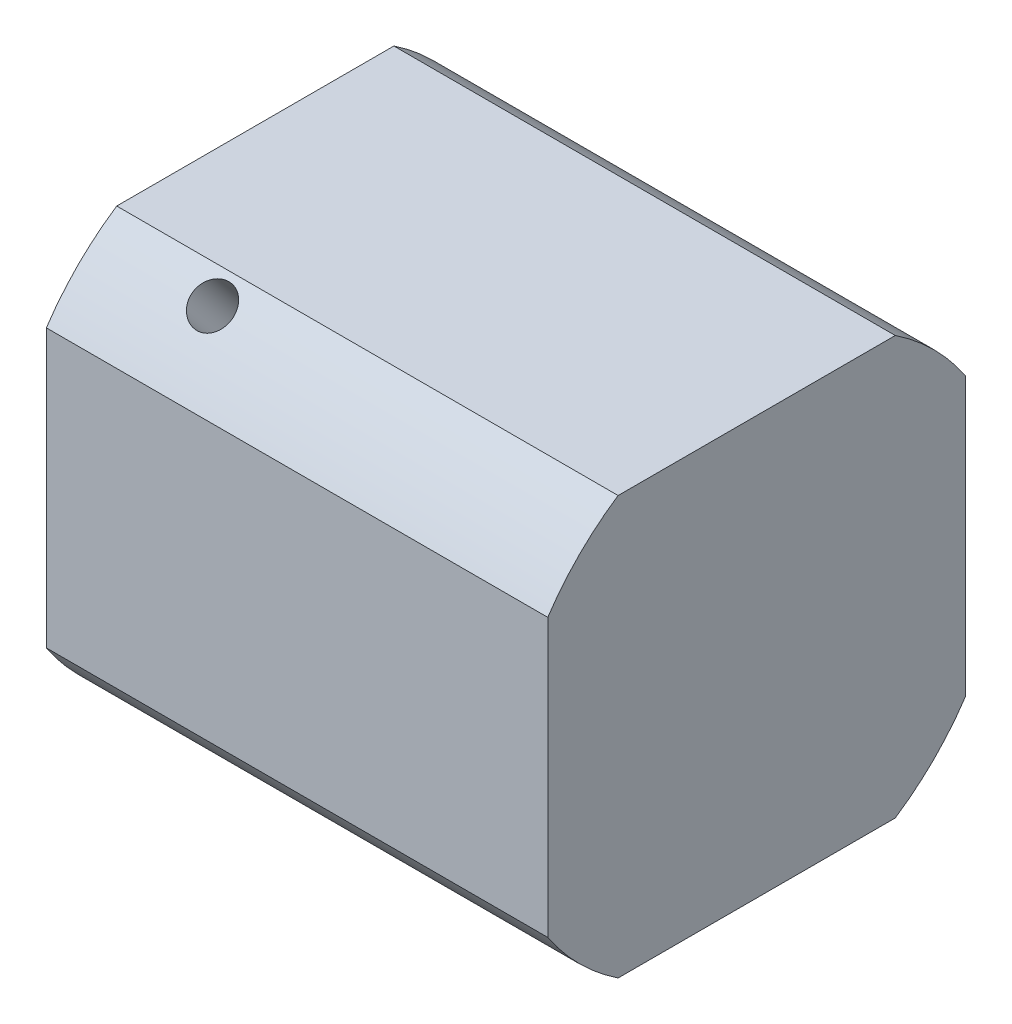
ISO-10303-21;
HEADER;
FILE_DESCRIPTION(('STEP AP214'),'2;1');
FILE_NAME('part.step','',(''),(''),'','','');
FILE_SCHEMA(('AUTOMOTIVE_DESIGN { 1 0 10303 214 1 1 1 1 }'));
ENDSEC;
DATA;
#1=APPLICATION_CONTEXT('core data for automotive mechanical design processes');
#2=APPLICATION_PROTOCOL_DEFINITION('international standard','automotive_design',2000,#1);
#3=PRODUCT_CONTEXT('',#1,'mechanical');
#4=PRODUCT('Part','Part','',(#3));
#5=PRODUCT_RELATED_PRODUCT_CATEGORY('part','',(#4));
#6=PRODUCT_DEFINITION_FORMATION('','',#4);
#7=PRODUCT_DEFINITION_CONTEXT('part definition',#1,'design');
#8=PRODUCT_DEFINITION('design','',#6,#7);
#9=PRODUCT_DEFINITION_SHAPE('','',#8);
#10=(LENGTH_UNIT() NAMED_UNIT(*) SI_UNIT(.MILLI.,.METRE.));
#11=(NAMED_UNIT(*) PLANE_ANGLE_UNIT() SI_UNIT($,.RADIAN.));
#12=(NAMED_UNIT(*) SI_UNIT($,.STERADIAN.) SOLID_ANGLE_UNIT());
#13=UNCERTAINTY_MEASURE_WITH_UNIT(LENGTH_MEASURE(1.E-05),#10,'distance_accuracy_value','');
#14=(GEOMETRIC_REPRESENTATION_CONTEXT(3) GLOBAL_UNCERTAINTY_ASSIGNED_CONTEXT((#13)) GLOBAL_UNIT_ASSIGNED_CONTEXT((#10,
#11,#12)) REPRESENTATION_CONTEXT('',''));
#15=CARTESIAN_POINT('',(0.,0.,0.));
#16=DIRECTION('',(0.,0.,1.));
#17=DIRECTION('',(1.,0.,0.));
#18=AXIS2_PLACEMENT_3D('',#15,#16,#17);
#19=CARTESIAN_POINT('',(8.94144685316528,14.6267227549851,12.2049777324172));
#20=DIRECTION('',(0.,0.767806968765624,0.640681245796179));
#21=DIRECTION('',(0.,-0.640681245796179,0.767806968765624));
#22=AXIS2_PLACEMENT_3D('',#19,#20,#21);
#23=CYLINDRICAL_SURFACE('',#22,1.57499999999999);
#24=CARTESIAN_POINT('',(8.94144685316528,-8.22176024778748,-4.80918739787728));
#25=CARTESIAN_POINT('',(9.02926399454272,-8.22175919164569,-4.80919112455586));
#26=CARTESIAN_POINT('',(9.11712934080105,-8.21799448924617,-4.81564323728923));
#27=CARTESIAN_POINT('',(9.29039540475437,-8.20296177163691,-4.84120383939345));
#28=CARTESIAN_POINT('',(9.37579376217142,-8.19168680391441,-4.86032405597937));
#29=CARTESIAN_POINT('',(9.54159318961236,-8.16174849114987,-4.91043098441002));
#30=CARTESIAN_POINT('',(9.62199834376408,-8.14309127892166,-4.94140784562869));
#31=CARTESIAN_POINT('',(9.775662297122,-8.09857757350153,-5.01402749850224));
#32=CARTESIAN_POINT('',(9.84892191394997,-8.07272190529458,-5.05566906787569));
#33=CARTESIAN_POINT('',(9.98693510663064,-8.01383832024917,-5.14850067728718));
#34=CARTESIAN_POINT('',(10.0516092797529,-7.9807500614335,-5.19977050646986));
#35=CARTESIAN_POINT('',(10.1699261798341,-7.90796457365892,-5.30980832658838));
#36=CARTESIAN_POINT('',(10.223568256973,-7.86826695564007,-5.36857675888191));
#37=CARTESIAN_POINT('',(10.3185958623459,-7.78263504962183,-5.4919833791585));
#38=CARTESIAN_POINT('',(10.3599075556684,-7.73666550203273,-5.55665401396031));
#39=CARTESIAN_POINT('',(10.4286271845358,-7.63956284496641,-5.68941649194032));
#40=CARTESIAN_POINT('',(10.4560360100818,-7.58843006626808,-5.75750811581494));
#41=CARTESIAN_POINT('',(10.4959291876926,-7.48266942826353,-5.89429263384931));
#42=CARTESIAN_POINT('',(10.5085469161604,-7.42807755739819,-5.96297443902625));
#43=CARTESIAN_POINT('',(10.5189144234418,-7.31642911407044,-6.09944749918406));
#44=CARTESIAN_POINT('',(10.5166651976883,-7.25937270687784,-6.16723881348416));
#45=CARTESIAN_POINT('',(10.4974667612196,-7.14503576534619,-6.29933718876725));
#46=CARTESIAN_POINT('',(10.4806610857017,-7.08776283985666,-6.3636717762989));
#47=CARTESIAN_POINT('',(10.4330527593047,-6.97422931630766,-6.48789920164634));
#48=CARTESIAN_POINT('',(10.4022496873818,-6.91796874875302,-6.54779190578654));
#49=CARTESIAN_POINT('',(10.3273779531169,-6.80806347840173,-6.66199762653039));
#50=CARTESIAN_POINT('',(10.2832500410035,-6.7544317291641,-6.7162842376669));
#51=CARTESIAN_POINT('',(10.183024652522,-6.65191253088368,-6.81783684886062));
#52=CARTESIAN_POINT('',(10.1269262222319,-6.60302546039282,-6.86510228889639));
#53=CARTESIAN_POINT('',(10.0035558353622,-6.51122305294064,-6.95224140262823));
#54=CARTESIAN_POINT('',(9.93615843924109,-6.46838600631264,-6.99202005844049));
#55=CARTESIAN_POINT('',(9.79252623001559,-6.39106139995046,-7.06276960242587));
#56=CARTESIAN_POINT('',(9.71629133785913,-6.35657391491228,-7.09374041180356));
#57=CARTESIAN_POINT('',(9.55700656867001,-6.29734437940789,-7.14637376680492));
#58=CARTESIAN_POINT('',(9.47394935636691,-6.27261298876448,-7.16802613313366));
#59=CARTESIAN_POINT('',(9.30345620714185,-6.23403834359794,-7.20160060056799));
#60=CARTESIAN_POINT('',(9.21602065004513,-6.22019414633585,-7.21352354416274));
#61=CARTESIAN_POINT('',(9.04035382397863,-6.20411982693464,-7.22735323917685));
#62=CARTESIAN_POINT('',(8.95214399848248,-6.20175506253321,-7.22937611084924));
#63=CARTESIAN_POINT('',(8.77647106065445,-6.20838193565479,-7.2236858383133));
#64=CARTESIAN_POINT('',(8.68900792007997,-6.21737314171673,-7.21597306400311));
#65=CARTESIAN_POINT('',(8.51786721378284,-6.24621341566057,-7.19102211908332));
#66=CARTESIAN_POINT('',(8.43416949990808,-6.26599465798727,-7.17384344378678));
#67=CARTESIAN_POINT('',(8.27229638016093,-6.31551399652409,-7.13028672848812));
#68=CARTESIAN_POINT('',(8.19412130030519,-6.3452526799562,-7.10390814593438));
#69=CARTESIAN_POINT('',(8.04473136517757,-6.41377615333873,-7.04210483514434));
#70=CARTESIAN_POINT('',(7.97358619381933,-6.45264067050654,-7.00660010201662));
#71=CARTESIAN_POINT('',(7.84099571492951,-6.5377320791714,-6.92726927540981));
#72=CARTESIAN_POINT('',(7.7795510790919,-6.58395948005163,-6.8834426061575));
#73=CARTESIAN_POINT('',(7.6674661610961,-6.68255257178213,-6.7877738093552));
#74=CARTESIAN_POINT('',(7.61694280589357,-6.73497620575577,-6.73585428910763));
#75=CARTESIAN_POINT('',(7.5289532741792,-6.84366738255725,-6.62539334367439));
#76=CARTESIAN_POINT('',(7.49148668044855,-6.89993480249113,-6.56685213015904));
#77=CARTESIAN_POINT('',(7.43085656628039,-7.01410719186957,-6.44475559386002));
#78=CARTESIAN_POINT('',(7.40763163316381,-7.0720039879709,-6.38122315197668));
#79=CARTESIAN_POINT('',(7.3759462790557,-7.18776013060921,-6.25054740023948));
#80=CARTESIAN_POINT('',(7.36748466307747,-7.24561947979825,-6.18340438308985));
#81=CARTESIAN_POINT('',(7.36560009484521,-7.35884187761506,-6.04820260596645));
#82=CARTESIAN_POINT('',(7.37199915295376,-7.41422645592679,-5.98016429006327));
#83=CARTESIAN_POINT('',(7.39926958902944,-7.52171112473261,-5.84439779852765));
#84=CARTESIAN_POINT('',(7.42014088903941,-7.5738112329174,-5.77666962122656));
#85=CARTESIAN_POINT('',(7.47569546563919,-7.67342296551739,-5.64367841605689));
#86=CARTESIAN_POINT('',(7.5103638381925,-7.72093947269542,-5.57841281105778));
#87=CARTESIAN_POINT('',(7.59250870452246,-7.81048552326937,-5.45233229515084));
#88=CARTESIAN_POINT('',(7.63998579003026,-7.85251481303615,-5.39151759002872));
#89=CARTESIAN_POINT('',(7.74703241093659,-7.93081904300463,-5.27566916073416));
#90=CARTESIAN_POINT('',(7.80673237602719,-7.96702368518996,-5.22070842797659));
#91=CARTESIAN_POINT('',(7.93625629136158,-8.03259193119149,-5.11925289365817));
#92=CARTESIAN_POINT('',(8.00608260965657,-8.06195393065478,-5.07276007807558));
#93=CARTESIAN_POINT('',(8.15445295267042,-8.11365609660982,-4.9896521806447));
#94=CARTESIAN_POINT('',(8.23305419334402,-8.13594604245148,-4.95310799568998));
#95=CARTESIAN_POINT('',(8.39632487069252,-8.17296948337121,-4.89177770251323));
#96=CARTESIAN_POINT('',(8.48098812761879,-8.18771055236758,-4.86697981091449));
#97=CARTESIAN_POINT('',(8.62856226132541,-8.206318085818,-4.83551326896205));
#98=CARTESIAN_POINT('',(8.69057804892894,-8.21210532589345,-4.82566158888635));
#99=CARTESIAN_POINT('',(8.81553659179634,-8.21982675144684,-4.81249737510196));
#100=CARTESIAN_POINT('',(8.87847933064532,-8.2217610050728,-4.80918472573703));
#101=CARTESIAN_POINT('',(8.94144685316528,-8.22176024778748,-4.80918739787728));
#102=B_SPLINE_CURVE_WITH_KNOTS('',3,(#24,#25,#26,#27,#28,#29,#30,#31,#32,#33,#34,#35,#36,#37,
#38,#39,#40,#41,#42,#43,#44,#45,#46,#47,#48,#49,#50,#51,#52,#53,#54,#55,#56,#57,#58,#59,#60,#61,
#62,#63,#64,#65,#66,#67,#68,#69,#70,#71,#72,#73,#74,#75,#76,#77,#78,#79,#80,#81,#82,#83,#84,#85,
#86,#87,#88,#89,#90,#91,#92,#93,#94,#95,#96,#97,#98,#99,#100,#101),.UNSPECIFIED.,.T.,.F.,(4,2,2,
2,2,2,2,2,2,2,2,2,2,2,2,2,2,2,2,2,2,2,2,2,2,2,2,2,2,2,2,2,2,2,2,2,2,2,4),(0.,0.263221171945587,
0.52668635612965,0.789933124104301,1.05314973487683,1.31865243166966,1.58417076280845,
1.85124852370316,2.11830918528511,2.38294267867809,2.64755845342946,2.90959428671084,
3.17163800259253,3.43486451410984,3.69811200979404,3.96450335602607,4.2308970853331,
4.49758108410441,4.76424198775115,5.02776754127061,5.29128308264712,5.55316095546549,
5.81505427477641,6.07932682986698,6.34361767595834,6.61061151748956,6.87759682665462,
7.14342259735303,7.4092268503262,7.67186395190721,7.93449963876049,8.19685238493934,
8.45921725324806,8.72454321048403,8.98993131463858,9.25716388944,9.52412781728391,
9.7128686254251,9.90160609526572),.UNSPECIFIED.);
#103=CARTESIAN_POINT('',(8.94144685316528,-8.22176024778748,-4.80918739787728));
#104=VERTEX_POINT('',#103);
#105=EDGE_CURVE('E38',#104,#104,#102,.T.);
#106=ORIENTED_EDGE('',*,*,#105,.T.);
#107=EDGE_LOOP('',(#106));
#108=FACE_BOUND('',#107,.T.);
#109=CARTESIAN_POINT('',(8.94144685316528,-15.5857194143861,-10.9538965823139));
#110=CARTESIAN_POINT('',(9.02975293434592,-15.5857176059114,-10.9539000987928));
#111=CARTESIAN_POINT('',(9.11811919436211,-15.5814234592147,-10.9600169726329));
#112=CARTESIAN_POINT('',(9.29240691443076,-15.5643170307222,-10.9842954884525));
#113=CARTESIAN_POINT('',(9.3783254862134,-15.5514950877057,-11.0024707914821));
#114=CARTESIAN_POINT('',(9.54516832167466,-15.5175889849179,-11.0502391302885));
#115=CARTESIAN_POINT('',(9.62609537981442,-15.4965094975687,-11.0798257090004));
#116=CARTESIAN_POINT('',(9.78070156522972,-15.4465158744083,-11.1494158622721));
#117=CARTESIAN_POINT('',(9.85438224132458,-15.4176034177737,-11.189417204117));
#118=CARTESIAN_POINT('',(9.99260981129438,-15.3524639047996,-11.2786258112236));
#119=CARTESIAN_POINT('',(10.0571358546553,-15.3162205927773,-11.3278535172076));
#120=CARTESIAN_POINT('',(10.1750433961016,-15.2372390336165,-11.4338710410171));
#121=CARTESIAN_POINT('',(10.2284244080875,-15.1945005033242,-11.4906611885078));
#122=CARTESIAN_POINT('',(10.3225958158341,-15.1034356020492,-11.6100978410472));
#123=CARTESIAN_POINT('',(10.3633681914421,-15.0551013679934,-11.6727525627362));
#124=CARTESIAN_POINT('',(10.4310496790062,-14.954066613043,-11.8019111640938));
#125=CARTESIAN_POINT('',(10.4579590302277,-14.9013661675241,-11.8684149773078));
#126=CARTESIAN_POINT('',(10.4970906482031,-14.7930857717811,-12.0031062159891));
#127=CARTESIAN_POINT('',(10.5093466222986,-14.7375127380813,-12.0712894078609));
#128=CARTESIAN_POINT('',(10.5189277806984,-14.6248947339669,-12.2074878975451));
#129=CARTESIAN_POINT('',(10.516253238744,-14.5678497905579,-12.2755031984128));
#130=CARTESIAN_POINT('',(10.4960768608438,-14.4540697918416,-12.4092731584012));
#131=CARTESIAN_POINT('',(10.4786112725838,-14.397334319918,-12.4750329354605));
#132=CARTESIAN_POINT('',(10.4294049438446,-14.2857307879138,-12.6026817933761));
#133=CARTESIAN_POINT('',(10.3976640693503,-14.2308627453696,-12.6645708378881));
#134=CARTESIAN_POINT('',(10.3207677531373,-14.1246337200355,-12.782940243306));
#135=CARTESIAN_POINT('',(10.2755960707414,-14.0732770762732,-12.8394139459528));
#136=CARTESIAN_POINT('',(10.173132190233,-13.9757934930027,-12.9454583671629));
#137=CARTESIAN_POINT('',(10.1158397501841,-13.9296666579122,-12.9950289479037));
#138=CARTESIAN_POINT('',(9.99055636711518,-13.8440422763043,-13.0862112857856));
#139=CARTESIAN_POINT('',(9.92253392842596,-13.8045649766378,-13.1277987874565));
#140=CARTESIAN_POINT('',(9.77783123847273,-13.7337624971235,-13.2018521778587));
#141=CARTESIAN_POINT('',(9.70115098023327,-13.7024373238438,-13.2343180592407));
#142=CARTESIAN_POINT('',(9.54128721348498,-13.6490404224496,-13.2893820049632));
#143=CARTESIAN_POINT('',(9.45810292213213,-13.626969810281,-13.3119788792795));
#144=CARTESIAN_POINT('',(9.28760292120565,-13.5928856795716,-13.3467807903607));
#145=CARTESIAN_POINT('',(9.20028729714746,-13.5808719529571,-13.3589860421252));
#146=CARTESIAN_POINT('',(9.02427964364052,-13.5673624513692,-13.3727061736215));
#147=CARTESIAN_POINT('',(8.93559244853414,-13.5658356752396,-13.3742525627578));
#148=CARTESIAN_POINT('',(8.75911629301448,-13.5732739820519,-13.3667034228312));
#149=CARTESIAN_POINT('',(8.67132732436395,-13.582238968691,-13.3576079914484));
#150=CARTESIAN_POINT('',(8.49926603638261,-13.6103119101839,-13.3290024473715));
#151=CARTESIAN_POINT('',(8.41498891361372,-13.6294054849789,-13.3095070997338));
#152=CARTESIAN_POINT('',(8.25219486062949,-13.6770387858237,-13.2605531428653));
#153=CARTESIAN_POINT('',(8.17367802143846,-13.7055786611052,-13.2310943762333));
#154=CARTESIAN_POINT('',(8.02443171487802,-13.7711758909971,-13.1628056625279));
#155=CARTESIAN_POINT('',(7.95372088731269,-13.80825300731,-13.1239539624323));
#156=CARTESIAN_POINT('',(7.82228219241605,-13.8896103799068,-13.0378189856798));
#157=CARTESIAN_POINT('',(7.7615544942298,-13.9338907582109,-12.9905355661917));
#158=CARTESIAN_POINT('',(7.65165557662873,-14.0282881178731,-12.8885400062747));
#159=CARTESIAN_POINT('',(7.60251297687583,-14.0784191055092,-12.8338099846533));
#160=CARTESIAN_POINT('',(7.51737558604019,-14.1827926363273,-12.718370174501));
#161=CARTESIAN_POINT('',(7.48138066534545,-14.2370351389709,-12.6576604449266));
#162=CARTESIAN_POINT('',(7.42360956890603,-14.3478455947979,-12.5319126650288));
#163=CARTESIAN_POINT('',(7.40181568033173,-14.4044105571736,-12.466880118583));
#164=CARTESIAN_POINT('',(7.37300740268123,-14.5182038135406,-12.3341758662625));
#165=CARTESIAN_POINT('',(7.36599273867813,-14.5754320951727,-12.266504209505));
#166=CARTESIAN_POINT('',(7.36694521665486,-14.6887089326043,-12.1306277935097));
#167=CARTESIAN_POINT('',(7.37486774953571,-14.7447604972141,-12.0624252254741));
#168=CARTESIAN_POINT('',(7.40537672379141,-14.8543097847326,-11.9272608592733));
#169=CARTESIAN_POINT('',(7.42796318533708,-14.9078075041283,-11.8602990628149));
#170=CARTESIAN_POINT('',(7.48714757330753,-15.0108499047398,-11.7296127396935));
#171=CARTESIAN_POINT('',(7.52374471769796,-15.0603948064036,-11.6658880325709));
#172=CARTESIAN_POINT('',(7.60990647108393,-15.1543206204145,-11.543613721667));
#173=CARTESIAN_POINT('',(7.65947087035417,-15.1987016162629,-11.4850640342084));
#174=CARTESIAN_POINT('',(7.77032758132035,-15.2813978899364,-11.3748032921989));
#175=CARTESIAN_POINT('',(7.83165288735075,-15.3196955352333,-11.3231121860081));
#176=CARTESIAN_POINT('',(7.96423134301271,-15.3892429852386,-11.2284087150631));
#177=CARTESIAN_POINT('',(8.03548689425319,-15.420491080226,-11.1853984559325));
#178=CARTESIAN_POINT('',(8.18603940124892,-15.47532426927,-11.1094124633015));
#179=CARTESIAN_POINT('',(8.26535099365917,-15.4988950758989,-11.0764554460253));
#180=CARTESIAN_POINT('',(8.42960356174333,-15.5377947396742,-11.0218224355655));
#181=CARTESIAN_POINT('',(8.51453793356577,-15.5531330793489,-11.000133464263));
#182=CARTESIAN_POINT('',(8.65688619554469,-15.5713651040083,-10.9742987301047));
#183=CARTESIAN_POINT('',(8.71338440123248,-15.5767427486386,-10.9666596927631));
#184=CARTESIAN_POINT('',(8.82706227221772,-15.5839204848772,-10.956457486569));
#185=CARTESIAN_POINT('',(8.8842419357175,-15.5857205859208,-10.9538943043294));
#186=CARTESIAN_POINT('',(8.94144685316528,-15.5857194143861,-10.9538965823139));
#187=B_SPLINE_CURVE_WITH_KNOTS('',3,(#109,#110,#111,#112,#113,#114,#115,#116,#117,#118,#119,
#120,#121,#122,#123,#124,#125,#126,#127,#128,#129,#130,#131,#132,#133,#134,#135,#136,#137,#138,
#139,#140,#141,#142,#143,#144,#145,#146,#147,#148,#149,#150,#151,#152,#153,#154,#155,#156,#157,
#158,#159,#160,#161,#162,#163,#164,#165,#166,#167,#168,#169,#170,#171,#172,#173,#174,#175,#176,
#177,#178,#179,#180,#181,#182,#183,#184,#185,#186),.UNSPECIFIED.,.T.,.F.,(4,2,2,2,2,2,2,2,2,2,2,
2,2,2,2,2,2,2,2,2,2,2,2,2,2,2,2,2,2,2,2,2,2,2,2,2,2,2,4),(0.,0.264709378720021,
0.529719161180244,0.794579207462513,1.05938251978288,1.32477958306579,1.5901882194375,
1.85597444092644,2.12175607499038,2.38692514476949,2.65208935286461,2.91660561034698,
3.18112435113602,3.44596426075637,3.71080945721035,3.97644703555231,4.24208482791534,
4.50775464256719,4.77341896045944,5.03829759149053,5.30317379124811,5.56767493567427,
5.83218025886277,6.097304116698,6.3624324660881,6.62820907754634,6.89398306886406,
7.15942492469851,7.42486184267223,7.6895073036178,7.95415312859427,8.21878418398673,
8.48341095964591,8.74879128281518,9.01423589940045,9.2801717226114,9.54580056791524,
9.71728046932578,9.88875991847445),.UNSPECIFIED.);
#188=CARTESIAN_POINT('',(8.94144685316528,-15.5857194143861,-10.9538965823139));
#189=VERTEX_POINT('',#188);
#190=EDGE_CURVE('E148',#189,#189,#187,.T.);
#191=ORIENTED_EDGE('',*,*,#190,.F.);
#192=EDGE_LOOP('',(#191));
#193=FACE_BOUND('',#192,.T.);
#194=ADVANCED_FACE('F34',(#108,#193),#23,.F.);
#195=CARTESIAN_POINT('',(0.,0.,0.));
#196=DIRECTION('',(1.,0.,0.));
#197=DIRECTION('',(0.,0.,-1.));
#198=AXIS2_PLACEMENT_3D('',#195,#196,#197);
#199=PLANE('',#198);
#200=CARTESIAN_POINT('',(0.,0.,0.));
#201=DIRECTION('',(-1.,0.,0.));
#202=DIRECTION('',(0.,0.,1.));
#203=AXIS2_PLACEMENT_3D('',#200,#201,#202);
#204=CIRCLE('',#203,9.525);
#205=CARTESIAN_POINT('',(0.,0.,9.525));
#206=VERTEX_POINT('',#205);
#207=EDGE_CURVE('E215',#206,#206,#204,.T.);
#208=ORIENTED_EDGE('',*,*,#207,.F.);
#209=EDGE_LOOP('',(#208));
#210=FACE_BOUND('',#209,.T.);
#211=DIRECTION('',(0.,1.,0.));
#212=VECTOR('',#211,1.);
#213=CARTESIAN_POINT('',(0.,15.875,15.875));
#214=LINE('',#213,#212);
#215=CARTESIAN_POINT('',(0.,-10.5302837093784,15.875));
#216=VERTEX_POINT('',#215);
#217=CARTESIAN_POINT('',(0.,10.5302837093784,15.875));
#218=VERTEX_POINT('',#217);
#219=EDGE_CURVE('E116',#216,#218,#214,.T.);
#220=ORIENTED_EDGE('',*,*,#219,.T.);
#221=CARTESIAN_POINT('',(0.,0.,0.));
#222=DIRECTION('',(-1.,0.,0.));
#223=DIRECTION('',(0.,0.,1.));
#224=AXIS2_PLACEMENT_3D('',#221,#222,#223);
#225=CIRCLE('',#224,19.05);
#226=CARTESIAN_POINT('',(0.,15.875,10.5302837093784));
#227=VERTEX_POINT('',#226);
#228=EDGE_CURVE('E123',#218,#227,#225,.T.);
#229=ORIENTED_EDGE('',*,*,#228,.T.);
#230=DIRECTION('',(0.,0.,-1.));
#231=VECTOR('',#230,1.);
#232=CARTESIAN_POINT('',(0.,15.875,15.875));
#233=LINE('',#232,#231);
#234=CARTESIAN_POINT('',(0.,15.875,-10.5302837093784));
#235=VERTEX_POINT('',#234);
#236=EDGE_CURVE('E104',#227,#235,#233,.T.);
#237=ORIENTED_EDGE('',*,*,#236,.T.);
#238=CARTESIAN_POINT('',(0.,10.5302837093784,-15.875));
#239=VERTEX_POINT('',#238);
#240=EDGE_CURVE('E131',#235,#239,#225,.T.);
#241=ORIENTED_EDGE('',*,*,#240,.T.);
#242=DIRECTION('',(0.,-1.,0.));
#243=VECTOR('',#242,1.);
#244=CARTESIAN_POINT('',(0.,15.875,-15.875));
#245=LINE('',#244,#243);
#246=CARTESIAN_POINT('',(0.,-10.5302837093784,-15.875));
#247=VERTEX_POINT('',#246);
#248=EDGE_CURVE('E115',#239,#247,#245,.T.);
#249=ORIENTED_EDGE('',*,*,#248,.T.);
#250=CARTESIAN_POINT('',(0.,-15.875,-10.5302837093784));
#251=VERTEX_POINT('',#250);
#252=EDGE_CURVE('E137',#247,#251,#225,.T.);
#253=ORIENTED_EDGE('',*,*,#252,.T.);
#254=DIRECTION('',(0.,0.,1.));
#255=VECTOR('',#254,1.);
#256=CARTESIAN_POINT('',(0.,-15.875,15.875));
#257=LINE('',#256,#255);
#258=CARTESIAN_POINT('',(0.,-15.875,10.5302837093784));
#259=VERTEX_POINT('',#258);
#260=EDGE_CURVE('E126',#251,#259,#257,.T.);
#261=ORIENTED_EDGE('',*,*,#260,.T.);
#262=EDGE_CURVE('E133',#259,#216,#225,.T.);
#263=ORIENTED_EDGE('',*,*,#262,.T.);
#264=EDGE_LOOP('',(#220,#229,#237,#241,#249,#253,#261,#263));
#265=FACE_BOUND('',#264,.T.);
#266=ADVANCED_FACE('F36',(#210,#265),#199,.F.);
#267=CARTESIAN_POINT('',(0.,0.,0.));
#268=DIRECTION('',(-1.,0.,0.));
#269=DIRECTION('',(0.,0.,1.));
#270=AXIS2_PLACEMENT_3D('',#267,#268,#269);
#271=CYLINDRICAL_SURFACE('',#270,19.05);
#272=CARTESIAN_POINT('',(8.94144685316528,13.5675734901281,13.3724885339256));
#273=CARTESIAN_POINT('',(8.85314077198465,13.5675766259608,13.3724861250342));
#274=CARTESIAN_POINT('',(8.76477451196845,13.5728257565207,13.3671661184747));
#275=CARTESIAN_POINT('',(8.59048679189981,13.5936489155074,13.3459889544534));
#276=CARTESIAN_POINT('',(8.50456822011716,13.6092346543182,13.330119845825));
#277=CARTESIAN_POINT('',(8.3377253846559,13.650159951382,13.2882085340009));
#278=CARTESIAN_POINT('',(8.25679832651615,13.6754939935433,13.2621720838867));
#279=CARTESIAN_POINT('',(8.10219214110085,13.7350078915435,13.2005259345023));
#280=CARTESIAN_POINT('',(8.02851146500599,13.7691858514153,13.1649182870508));
#281=CARTESIAN_POINT('',(7.89028389503619,13.8452892018586,13.084858235941));
#282=CARTESIAN_POINT('',(7.82575785167525,13.8872317921484,13.0403861792921));
#283=CARTESIAN_POINT('',(7.70785031022897,13.9773939225187,12.943698060636));
#284=CARTESIAN_POINT('',(7.65446929824311,14.0256137362367,12.8914816610228));
#285=CARTESIAN_POINT('',(7.56029789049648,14.126814545656,12.7805027153307));
#286=CARTESIAN_POINT('',(7.51952551488848,14.1798022172858,12.7217309620224));
#287=CARTESIAN_POINT('',(7.45184402732439,14.2887827066269,12.5992025206078));
#288=CARTESIAN_POINT('',(7.42493467610287,14.3447754724541,12.5354459185581));
#289=CARTESIAN_POINT('',(7.38580305812743,14.4579018176366,12.4047982859526));
#290=CARTESIAN_POINT('',(7.37354708403198,14.515032470254,12.3379148181902));
#291=CARTESIAN_POINT('',(7.36396592563214,14.6288650370069,12.20272979613));
#292=CARTESIAN_POINT('',(7.36664046758659,14.6855669589839,12.1344282678543));
#293=CARTESIAN_POINT('',(7.38681684548677,14.7968021823472,11.9985348707135));
#294=CARTESIAN_POINT('',(7.40428243374675,14.8513404443643,11.930941675572));
#295=CARTESIAN_POINT('',(7.45348876248597,14.9569431959029,11.7982855858118));
#296=CARTESIAN_POINT('',(7.48522963698031,15.0080076528074,11.7332227149539));
#297=CARTESIAN_POINT('',(7.56212595319328,15.1054432493465,11.6075158078664));
#298=CARTESIAN_POINT('',(7.60729763558912,15.1518086152507,11.546877232737));
#299=CARTESIAN_POINT('',(7.70976151609755,15.2386843268794,11.431981284131));
#300=CARTESIAN_POINT('',(7.76705395614642,15.2791945557053,11.3777240380627));
#301=CARTESIAN_POINT('',(7.89233733921538,15.353571819716,11.2771567667185));
#302=CARTESIAN_POINT('',(7.96035977790461,15.3874186167237,11.2308710041503));
#303=CARTESIAN_POINT('',(8.10506246785783,15.4475976902121,11.1479531239947));
#304=CARTESIAN_POINT('',(8.18174272609729,15.4739299606384,11.111321014185));
#305=CARTESIAN_POINT('',(8.34160649284559,15.51854303413,11.0489275780666));
#306=CARTESIAN_POINT('',(8.42479078419843,15.5368228662187,11.0231675627488));
#307=CARTESIAN_POINT('',(8.59529078512491,15.564959408536,10.9834028048903));
#308=CARTESIAN_POINT('',(8.6826064091831,15.5748162930328,10.9693978191417));
#309=CARTESIAN_POINT('',(8.85861406269004,15.5858957492554,10.953649984648));
#310=CARTESIAN_POINT('',(8.94730125779642,15.5871437702492,10.9518709938357));
#311=CARTESIAN_POINT('',(9.12377741331608,15.5810484982317,10.9605408024206));
#312=CARTESIAN_POINT('',(9.21156638196661,15.5737052840785,10.9709894895812));
#313=CARTESIAN_POINT('',(9.38362766994795,15.5505886356102,11.0037307137426));
#314=CARTESIAN_POINT('',(9.46790479271683,15.5348271529114,11.0260064593217));
#315=CARTESIAN_POINT('',(9.63069884570107,15.4951933230806,11.081635415589));
#316=CARTESIAN_POINT('',(9.7092156848921,15.4713208478118,11.1149888012808));
#317=CARTESIAN_POINT('',(9.85846199145254,15.4158812619706,11.1917533589282));
#318=CARTESIAN_POINT('',(9.92917281901787,15.3842962883589,11.2351878682075));
#319=CARTESIAN_POINT('',(10.0606115139145,15.3141207856787,11.3306533337937));
#320=CARTESIAN_POINT('',(10.1213392121008,15.2755301379358,11.3826844357236));
#321=CARTESIAN_POINT('',(10.2312381297018,15.1920852501344,11.4938190678316));
#322=CARTESIAN_POINT('',(10.2803807294547,15.1472159257559,11.5529395796516));
#323=CARTESIAN_POINT('',(10.3655181202904,15.0523303437177,11.6762964198539));
#324=CARTESIAN_POINT('',(10.4015130409851,15.0023141368031,11.7405326977965));
#325=CARTESIAN_POINT('',(10.4592841374245,14.8984397357362,11.872068130562));
#326=CARTESIAN_POINT('',(10.4810780259988,14.8445864209943,11.9393633574143));
#327=CARTESIAN_POINT('',(10.5098863036493,14.7344020563008,12.0750789775751));
#328=CARTESIAN_POINT('',(10.5169009676524,14.6780710524596,12.1434993499296));
#329=CARTESIAN_POINT('',(10.5159484896757,14.564673321833,12.279274889004));
#330=CARTESIAN_POINT('',(10.5080259567949,14.5076092895806,12.3466326235632));
#331=CARTESIAN_POINT('',(10.4775169825391,14.3942446645902,12.4786133573355));
#332=CARTESIAN_POINT('',(10.4549305209935,14.3379440729025,12.5432363527867));
#333=CARTESIAN_POINT('',(10.395746133023,14.2278200303914,12.668013540749));
#334=CARTESIAN_POINT('',(10.3591489886326,14.173996441497,12.7281679824576));
#335=CARTESIAN_POINT('',(10.2729872352466,14.0705160939327,12.8424697029722));
#336=CARTESIAN_POINT('',(10.2234228359764,14.020859267889,12.896617078913));
#337=CARTESIAN_POINT('',(10.1125661250102,13.9271876322673,12.9977196485535));
#338=CARTESIAN_POINT('',(10.0512408189798,13.8831892914711,13.0446539228282));
#339=CARTESIAN_POINT('',(9.91866236331786,13.802469142935,13.1300345578199));
#340=CARTESIAN_POINT('',(9.84740681207737,13.7657491006558,13.1684788594242));
#341=CARTESIAN_POINT('',(9.69685430508165,13.7008092750018,13.236031570257));
#342=CARTESIAN_POINT('',(9.6175427126714,13.6726053471427,13.2651225717214));
#343=CARTESIAN_POINT('',(9.45329014458724,13.6258204405119,13.3131758981961));
#344=CARTESIAN_POINT('',(9.3683557727648,13.607228391255,13.3321498762863));
#345=CARTESIAN_POINT('',(9.22600751078588,13.5850757076101,13.3547130945748));
#346=CARTESIAN_POINT('',(9.16950930509809,13.5785230189681,13.3613716398241));
#347=CARTESIAN_POINT('',(9.05583143411284,13.5697709002673,13.3702601339027));
#348=CARTESIAN_POINT('',(8.99865177061307,13.5675714587273,13.372490094412));
#349=CARTESIAN_POINT('',(8.94144685316528,13.5675734901281,13.3724885339256));
#350=B_SPLINE_CURVE_WITH_KNOTS('',3,(#272,#273,#274,#275,#276,#277,#278,#279,#280,#281,#282,
#283,#284,#285,#286,#287,#288,#289,#290,#291,#292,#293,#294,#295,#296,#297,#298,#299,#300,#301,
#302,#303,#304,#305,#306,#307,#308,#309,#310,#311,#312,#313,#314,#315,#316,#317,#318,#319,#320,
#321,#322,#323,#324,#325,#326,#327,#328,#329,#330,#331,#332,#333,#334,#335,#336,#337,#338,#339,
#340,#341,#342,#343,#344,#345,#346,#347,#348,#349),.UNSPECIFIED.,.T.,.F.,(4,2,2,2,2,2,2,2,2,2,2,
2,2,2,2,2,2,2,2,2,2,2,2,2,2,2,2,2,2,2,2,2,2,2,2,2,2,2,4),(0.,0.264709378720021,
0.529719161180242,0.794579207462512,1.05938251978288,1.32477958306579,1.59018821943749,
1.85597444092644,2.12175607499038,2.38692514476948,2.6520893528646,2.91660561034698,
3.18112435113602,3.44596426075637,3.71080945721035,3.97644703555231,4.24208482791534,
4.50775464256719,4.77341896045944,5.03829759149052,5.3031737912481,5.56767493567427,
5.83218025886277,6.097304116698,6.36243246608809,6.62820907754634,6.89398306886406,
7.1594249246985,7.42486184267223,7.6895073036178,7.95415312859427,8.21878418398672,
8.48341095964591,8.74879128281518,9.01423589940044,9.2801717226114,9.54580056791524,
9.71728046932578,9.88875991847445),.UNSPECIFIED.);
#351=CARTESIAN_POINT('',(8.94144685316528,13.5675734901281,13.3724885339256));
#352=VERTEX_POINT('',#351);
#353=EDGE_CURVE('E130',#352,#352,#350,.T.);
#354=ORIENTED_EDGE('',*,*,#353,.T.);
#355=EDGE_LOOP('',(#354));
#356=FACE_BOUND('',#355,.T.);
#357=DIRECTION('',(-1.,0.,0.));
#358=VECTOR('',#357,1.);
#359=CARTESIAN_POINT('',(0.,10.5302837093784,15.875));
#360=LINE('',#359,#358);
#361=CARTESIAN_POINT('',(38.1,10.5302837093784,15.875));
#362=VERTEX_POINT('',#361);
#363=EDGE_CURVE('E154',#362,#218,#360,.T.);
#364=ORIENTED_EDGE('',*,*,#363,.F.);
#365=CARTESIAN_POINT('',(38.1,0.,0.));
#366=DIRECTION('',(-1.,0.,0.));
#367=DIRECTION('',(0.,0.,1.));
#368=AXIS2_PLACEMENT_3D('',#365,#366,#367);
#369=CIRCLE('',#368,19.05);
#370=CARTESIAN_POINT('',(38.1,15.875,10.5302837093784));
#371=VERTEX_POINT('',#370);
#372=EDGE_CURVE('E125',#362,#371,#369,.T.);
#373=ORIENTED_EDGE('',*,*,#372,.T.);
#374=DIRECTION('',(-1.,0.,0.));
#375=VECTOR('',#374,1.);
#376=CARTESIAN_POINT('',(0.,15.875,10.5302837093784));
#377=LINE('',#376,#375);
#378=EDGE_CURVE('E107',#227,#371,#377,.F.);
#379=ORIENTED_EDGE('',*,*,#378,.F.);
#380=ORIENTED_EDGE('',*,*,#228,.F.);
#381=EDGE_LOOP('',(#364,#373,#379,#380));
#382=FACE_BOUND('',#381,.T.);
#383=ADVANCED_FACE('F122',(#356,#382),#271,.T.);
#384=DIRECTION('',(-1.,0.,0.));
#385=VECTOR('',#384,1.);
#386=CARTESIAN_POINT('',(0.,-10.5302837093784,15.875));
#387=LINE('',#386,#385);
#388=CARTESIAN_POINT('',(38.1,-10.5302837093784,15.875));
#389=VERTEX_POINT('',#388);
#390=EDGE_CURVE('E55',#216,#389,#387,.F.);
#391=ORIENTED_EDGE('',*,*,#390,.F.);
#392=ORIENTED_EDGE('',*,*,#262,.F.);
#393=DIRECTION('',(-1.,0.,0.));
#394=VECTOR('',#393,1.);
#395=CARTESIAN_POINT('',(0.,-15.875,10.5302837093784));
#396=LINE('',#395,#394);
#397=CARTESIAN_POINT('',(38.1,-15.875,10.5302837093784));
#398=VERTEX_POINT('',#397);
#399=EDGE_CURVE('E227',#398,#259,#396,.T.);
#400=ORIENTED_EDGE('',*,*,#399,.F.);
#401=EDGE_CURVE('E143',#398,#389,#369,.T.);
#402=ORIENTED_EDGE('',*,*,#401,.T.);
#403=EDGE_LOOP('',(#391,#392,#400,#402));
#404=FACE_BOUND('',#403,.T.);
#405=ADVANCED_FACE('F230',(#404),#271,.T.);
#406=ORIENTED_EDGE('',*,*,#190,.T.);
#407=EDGE_LOOP('',(#406));
#408=FACE_BOUND('',#407,.T.);
#409=DIRECTION('',(-1.,0.,0.));
#410=VECTOR('',#409,1.);
#411=CARTESIAN_POINT('',(0.,-15.875,-10.5302837093784));
#412=LINE('',#411,#410);
#413=CARTESIAN_POINT('',(38.1,-15.875,-10.5302837093784));
#414=VERTEX_POINT('',#413);
#415=EDGE_CURVE('E63',#251,#414,#412,.F.);
#416=ORIENTED_EDGE('',*,*,#415,.F.);
#417=ORIENTED_EDGE('',*,*,#252,.F.);
#418=DIRECTION('',(-1.,0.,0.));
#419=VECTOR('',#418,1.);
#420=CARTESIAN_POINT('',(0.,-10.5302837093784,-15.875));
#421=LINE('',#420,#419);
#422=CARTESIAN_POINT('',(38.1,-10.5302837093784,-15.875));
#423=VERTEX_POINT('',#422);
#424=EDGE_CURVE('E224',#423,#247,#421,.T.);
#425=ORIENTED_EDGE('',*,*,#424,.F.);
#426=EDGE_CURVE('E145',#423,#414,#369,.T.);
#427=ORIENTED_EDGE('',*,*,#426,.T.);
#428=EDGE_LOOP('',(#416,#417,#425,#427));
#429=FACE_BOUND('',#428,.T.);
#430=ADVANCED_FACE('F232',(#408,#429),#271,.T.);
#431=DIRECTION('',(-1.,0.,0.));
#432=VECTOR('',#431,1.);
#433=CARTESIAN_POINT('',(0.,10.5302837093784,-15.875));
#434=LINE('',#433,#432);
#435=CARTESIAN_POINT('',(38.1,10.5302837093784,-15.875));
#436=VERTEX_POINT('',#435);
#437=EDGE_CURVE('E222',#239,#436,#434,.F.);
#438=ORIENTED_EDGE('',*,*,#437,.F.);
#439=ORIENTED_EDGE('',*,*,#240,.F.);
#440=DIRECTION('',(-1.,0.,0.));
#441=VECTOR('',#440,1.);
#442=CARTESIAN_POINT('',(0.,15.875,-10.5302837093784));
#443=LINE('',#442,#441);
#444=CARTESIAN_POINT('',(38.1,15.875,-10.5302837093784));
#445=VERTEX_POINT('',#444);
#446=EDGE_CURVE('E110',#445,#235,#443,.T.);
#447=ORIENTED_EDGE('',*,*,#446,.F.);
#448=EDGE_CURVE('E142',#445,#436,#369,.T.);
#449=ORIENTED_EDGE('',*,*,#448,.T.);
#450=EDGE_LOOP('',(#438,#439,#447,#449));
#451=FACE_BOUND('',#450,.T.);
#452=ADVANCED_FACE('F237',(#451),#271,.T.);
#453=CARTESIAN_POINT('',(38.1,0.,-9.525));
#454=DIRECTION('',(-1.,0.,0.));
#455=DIRECTION('',(0.,0.,1.));
#456=AXIS2_PLACEMENT_3D('',#453,#454,#455);
#457=PLANE('',#456);
#458=DIRECTION('',(0.,1.,0.));
#459=VECTOR('',#458,1.);
#460=CARTESIAN_POINT('',(38.1,0.,15.875));
#461=LINE('',#460,#459);
#462=EDGE_CURVE('E11',#389,#362,#461,.T.);
#463=ORIENTED_EDGE('',*,*,#462,.F.);
#464=ORIENTED_EDGE('',*,*,#401,.F.);
#465=DIRECTION('',(0.,0.,1.));
#466=VECTOR('',#465,1.);
#467=CARTESIAN_POINT('',(38.1,-15.875,-9.525));
#468=LINE('',#467,#466);
#469=EDGE_CURVE('E48',#414,#398,#468,.T.);
#470=ORIENTED_EDGE('',*,*,#469,.F.);
#471=ORIENTED_EDGE('',*,*,#426,.F.);
#472=DIRECTION('',(0.,-1.,0.));
#473=VECTOR('',#472,1.);
#474=CARTESIAN_POINT('',(38.1,0.,-15.875));
#475=LINE('',#474,#473);
#476=EDGE_CURVE('E253',#436,#423,#475,.T.);
#477=ORIENTED_EDGE('',*,*,#476,.F.);
#478=ORIENTED_EDGE('',*,*,#448,.F.);
#479=DIRECTION('',(0.,0.,-1.));
#480=VECTOR('',#479,1.);
#481=CARTESIAN_POINT('',(38.1,15.875,-9.525));
#482=LINE('',#481,#480);
#483=EDGE_CURVE('E135',#371,#445,#482,.T.);
#484=ORIENTED_EDGE('',*,*,#483,.F.);
#485=ORIENTED_EDGE('',*,*,#372,.F.);
#486=EDGE_LOOP('',(#463,#464,#470,#471,#477,#478,#484,#485));
#487=FACE_BOUND('',#486,.T.);
#488=ADVANCED_FACE('F172',(#487),#457,.F.);
#489=CARTESIAN_POINT('',(8.94144685316528,6.20361432352953,7.22777934948898));
#490=CARTESIAN_POINT('',(8.85362971178784,6.20361780087389,7.2277776431347));
#491=CARTESIAN_POINT('',(8.76576436552951,6.20929155224059,7.22291849832209));
#492=CARTESIAN_POINT('',(8.5924983015762,6.23174738625376,7.20355196798176));
#493=CARTESIAN_POINT('',(8.50709994415915,6.24853976170961,7.18903564248301));
#494=CARTESIAN_POINT('',(8.3413005167182,6.29247630753921,7.15060926106991));
#495=CARTESIAN_POINT('',(8.26089536256648,6.31961188459385,7.12670700266195));
#496=CARTESIAN_POINT('',(8.10723140920857,6.38308752972943,7.06990976304304));
#497=CARTESIAN_POINT('',(8.03397179238059,6.41942654299991,7.03701581234021));
#498=CARTESIAN_POINT('',(7.89595859969993,6.50021450028289,6.96246187044731));
#499=CARTESIAN_POINT('',(7.83128442657766,6.54473113943398,6.92072822581177));
#500=CARTESIAN_POINT('',(7.71296752649644,6.63995803238164,6.82941618965796));
#501=CARTESIAN_POINT('',(7.65932544935757,6.69066865073998,6.77983733633999));
#502=CARTESIAN_POINT('',(7.56429784398471,6.79674807486292,6.67349274064209));
#503=CARTESIAN_POINT('',(7.52298615066221,6.85214248966613,6.61668649873308));
#504=CARTESIAN_POINT('',(7.45426652179474,6.96537267567312,6.49738131634122));
#505=CARTESIAN_POINT('',(7.42685769624875,7.02320829034512,6.43488274055898));
#506=CARTESIAN_POINT('',(7.38696451863793,7.13884526092871,6.30633933170707));
#507=CARTESIAN_POINT('',(7.37434679017012,7.19664215097926,6.24033189100962));
#508=CARTESIAN_POINT('',(7.36397928288875,7.31091845567299,6.10605159747444));
#509=CARTESIAN_POINT('',(7.36622850864223,7.36739795826916,6.0377788966142));
#510=CARTESIAN_POINT('',(7.38542694511092,7.47688888788136,5.90163686312014));
#511=CARTESIAN_POINT('',(7.40223262062884,7.52992875899408,5.83377008760116));
#512=CARTESIAN_POINT('',(7.44984094702583,7.63181979676781,5.69982782168298));
#513=CARTESIAN_POINT('',(7.48064401894875,7.68067083737561,5.63375238523091));
#514=CARTESIAN_POINT('',(7.55551575321367,7.77335178798306,5.50517417363925));
#515=CARTESIAN_POINT('',(7.59964366532702,7.81715803865357,5.44268887074995));
#516=CARTESIAN_POINT('',(7.6998690538086,7.89871287971912,5.32364296886712));
#517=CARTESIAN_POINT('',(7.75596748409867,7.93646098692484,5.26708284258244));
#518=CARTESIAN_POINT('',(7.87933787096836,8.00575416219888,5.16116134799127));
#519=CARTESIAN_POINT('',(7.94673526708948,8.03721976624471,5.11189401820701));
#520=CARTESIAN_POINT('',(8.09036747631497,8.09298056664992,5.02315098545866));
#521=CARTESIAN_POINT('',(8.16660236847143,8.11727569886198,4.98367537009213));
#522=CARTESIAN_POINT('',(8.32588713766055,8.15845309950396,4.9159787703907));
#523=CARTESIAN_POINT('',(8.40894434996366,8.17532726184146,4.88777009626023));
#524=CARTESIAN_POINT('',(8.57943749918872,8.20145214772968,4.84380717494521));
#525=CARTESIAN_POINT('',(8.66687305628544,8.21070353135194,4.82805184940529));
#526=CARTESIAN_POINT('',(8.84253988235194,8.2214315367765,4.80976102908454));
#527=CARTESIAN_POINT('',(8.93074970784809,8.22299829383691,4.80707227606671));
#528=CARTESIAN_POINT('',(9.10642264567612,8.21858655682169,4.8146109248456));
#529=CARTESIAN_POINT('',(9.1938857862506,8.212608349411,4.82483783592192));
#530=CARTESIAN_POINT('',(9.36502649254773,8.19322463308292,4.85767961715951));
#531=CARTESIAN_POINT('',(9.44872420642249,8.17986551346744,4.88021710495276));
#532=CARTESIAN_POINT('',(9.61059732616964,8.14587940529305,4.93673521521745));
#533=CARTESIAN_POINT('',(9.68877240602538,8.12525198809573,4.97071651256743));
#534=CARTESIAN_POINT('',(9.838162341153,8.07671695367113,5.04919877847776));
#535=CARTESIAN_POINT('',(9.90930751251123,8.04874490007091,5.0937925110704));
#536=CARTESIAN_POINT('',(10.0418979914011,7.98593218414646,5.19171334949044));
#537=CARTESIAN_POINT('',(10.1033426272387,7.95109104656169,5.24504105956403));
#538=CARTESIAN_POINT('',(10.2154275452345,7.87462194252819,5.3591707776347));
#539=CARTESIAN_POINT('',(10.265950900437,7.8329282091321,5.42004364989514));
#540=CARTESIAN_POINT('',(10.3539404321514,7.74371412508999,5.54675686778903));
#541=CARTESIAN_POINT('',(10.391407025882,7.69619396068871,5.61259705461395));
#542=CARTESIAN_POINT('',(10.4520371400502,7.59651376694707,5.74678631516869));
#543=CARTESIAN_POINT('',(10.4752620731668,7.5443747852513,5.81512325070276));
#544=CARTESIAN_POINT('',(10.5069474272749,7.43653760340913,5.95240682168968));
#545=CARTESIAN_POINT('',(10.5154090432531,7.38083969171143,6.02135340734155));
#546=CARTESIAN_POINT('',(10.5172936114854,7.26809594946226,6.15695458907817));
#547=CARTESIAN_POINT('',(10.5108945533768,7.21107408758514,6.22362670629199));
#548=CARTESIAN_POINT('',(10.4836241173011,7.09674738770298,6.35368400115178));
#549=CARTESIAN_POINT('',(10.4627528172912,7.03944255122389,6.41706919650132));
#550=CARTESIAN_POINT('',(10.4071982406914,6.92643659720264,6.53888386014983));
#551=CARTESIAN_POINT('',(10.3725298681381,6.87073381846233,6.59731859374987));
#552=CARTESIAN_POINT('',(10.2903850018081,6.76272455887774,6.7079928523141));
#553=CARTESIAN_POINT('',(10.2429079163003,6.7104182350799,6.76023209090106));
#554=CARTESIAN_POINT('',(10.135861295394,6.61046279675653,6.85801410024099));
#555=CARTESIAN_POINT('',(10.0761613303034,6.56287290681817,6.90347463957648));
#556=CARTESIAN_POINT('',(9.94663741496899,6.47479731796212,6.98614936954405));
#557=CARTESIAN_POINT('',(9.876811096674,6.43431328565982,7.0233616261516));
#558=CARTESIAN_POINT('',(9.72844075366015,6.36180602635157,7.08910912745339));
#559=CARTESIAN_POINT('',(9.64983951298654,6.32984355821541,7.1175822686618));
#560=CARTESIAN_POINT('',(9.48656883563804,6.27613365607677,7.16498887633353));
#561=CARTESIAN_POINT('',(9.40190557871178,6.25437598527671,7.18393190418692));
#562=CARTESIAN_POINT('',(9.25433144500515,6.22674974595622,7.20787296649753));
#563=CARTESIAN_POINT('',(9.19231565740162,6.21809351313368,7.21533067266813));
#564=CARTESIAN_POINT('',(9.06735711453422,6.20652460603271,7.22528443203967));
#565=CARTESIAN_POINT('',(9.00441437568524,6.20361183016939,7.22778057299614));
#566=CARTESIAN_POINT('',(8.94144685316528,6.20361432352953,7.22777934948898));
#567=B_SPLINE_CURVE_WITH_KNOTS('',3,(#489,#490,#491,#492,#493,#494,#495,#496,#497,#498,#499,
#500,#501,#502,#503,#504,#505,#506,#507,#508,#509,#510,#511,#512,#513,#514,#515,#516,#517,#518,
#519,#520,#521,#522,#523,#524,#525,#526,#527,#528,#529,#530,#531,#532,#533,#534,#535,#536,#537,
#538,#539,#540,#541,#542,#543,#544,#545,#546,#547,#548,#549,#550,#551,#552,#553,#554,#555,#556,
#557,#558,#559,#560,#561,#562,#563,#564,#565,#566),.UNSPECIFIED.,.T.,.F.,(4,2,2,2,2,2,2,2,2,2,2,
2,2,2,2,2,2,2,2,2,2,2,2,2,2,2,2,2,2,2,2,2,2,2,2,2,2,2,4),(0.,0.263221171945586,0.52668635612965,
0.789933124104301,1.05314973487683,1.31865243166966,1.58417076280846,1.85124852370316,
2.11830918528511,2.38294267867809,2.64755845342946,2.90959428671084,3.17163800259253,
3.43486451410984,3.69811200979404,3.96450335602607,4.2308970853331,4.49758108410441,
4.76424198775116,5.02776754127061,5.29128308264712,5.5531609554655,5.81505427477641,
6.07932682986698,6.34361767595833,6.61061151748956,6.87759682665462,7.14342259735304,
7.4092268503262,7.67186395190721,7.93449963876049,8.19685238493934,8.45921725324806,
8.72454321048402,8.98993131463858,9.25716388944,9.52412781728391,9.71286862542511,
9.90160609526572),.UNSPECIFIED.);
#568=CARTESIAN_POINT('',(8.94144685316528,6.20361432352953,7.22777934948898));
#569=VERTEX_POINT('',#568);
#570=EDGE_CURVE('E179',#569,#569,#567,.T.);
#571=ORIENTED_EDGE('',*,*,#570,.T.);
#572=EDGE_LOOP('',(#571));
#573=FACE_BOUND('',#572,.T.);
#574=ORIENTED_EDGE('',*,*,#353,.F.);
#575=EDGE_LOOP('',(#574));
#576=FACE_BOUND('',#575,.T.);
#577=ADVANCED_FACE('F168',(#573,#576),#23,.F.);
#578=CARTESIAN_POINT('',(38.1,15.875,15.875));
#579=DIRECTION('',(0.,1.,0.));
#580=DIRECTION('',(0.,0.,1.));
#581=AXIS2_PLACEMENT_3D('',#578,#579,#580);
#582=PLANE('',#581);
#583=ORIENTED_EDGE('',*,*,#446,.T.);
#584=ORIENTED_EDGE('',*,*,#236,.F.);
#585=ORIENTED_EDGE('',*,*,#378,.T.);
#586=ORIENTED_EDGE('',*,*,#483,.T.);
#587=EDGE_LOOP('',(#583,#584,#585,#586));
#588=FACE_BOUND('',#587,.T.);
#589=ADVANCED_FACE('F106',(#588),#582,.T.);
#590=CARTESIAN_POINT('',(38.1,15.875,-15.875));
#591=DIRECTION('',(0.,0.,-1.));
#592=DIRECTION('',(0.,1.,0.));
#593=AXIS2_PLACEMENT_3D('',#590,#591,#592);
#594=PLANE('',#593);
#595=ORIENTED_EDGE('',*,*,#424,.T.);
#596=ORIENTED_EDGE('',*,*,#248,.F.);
#597=ORIENTED_EDGE('',*,*,#437,.T.);
#598=ORIENTED_EDGE('',*,*,#476,.T.);
#599=EDGE_LOOP('',(#595,#596,#597,#598));
#600=FACE_BOUND('',#599,.T.);
#601=ADVANCED_FACE('F197',(#600),#594,.T.);
#602=CARTESIAN_POINT('',(38.1,-15.875,15.875));
#603=DIRECTION('',(0.,-1.,0.));
#604=DIRECTION('',(0.,0.,-1.));
#605=AXIS2_PLACEMENT_3D('',#602,#603,#604);
#606=PLANE('',#605);
#607=ORIENTED_EDGE('',*,*,#399,.T.);
#608=ORIENTED_EDGE('',*,*,#260,.F.);
#609=ORIENTED_EDGE('',*,*,#415,.T.);
#610=ORIENTED_EDGE('',*,*,#469,.T.);
#611=EDGE_LOOP('',(#607,#608,#609,#610));
#612=FACE_BOUND('',#611,.T.);
#613=ADVANCED_FACE('F193',(#612),#606,.T.);
#614=CARTESIAN_POINT('',(38.1,15.875,15.875));
#615=DIRECTION('',(0.,0.,1.));
#616=DIRECTION('',(0.,-1.,0.));
#617=AXIS2_PLACEMENT_3D('',#614,#615,#616);
#618=PLANE('',#617);
#619=ORIENTED_EDGE('',*,*,#363,.T.);
#620=ORIENTED_EDGE('',*,*,#219,.F.);
#621=ORIENTED_EDGE('',*,*,#390,.T.);
#622=ORIENTED_EDGE('',*,*,#462,.T.);
#623=EDGE_LOOP('',(#619,#620,#621,#622));
#624=FACE_BOUND('',#623,.T.);
#625=ADVANCED_FACE('F174',(#624),#618,.T.);
#626=CARTESIAN_POINT('',(25.4,0.,0.));
#627=DIRECTION('',(-1.,0.,0.));
#628=DIRECTION('',(0.,0.,1.));
#629=AXIS2_PLACEMENT_3D('',#626,#627,#628);
#630=CYLINDRICAL_SURFACE('',#629,9.525);
#631=ORIENTED_EDGE('',*,*,#570,.F.);
#632=EDGE_LOOP('',(#631));
#633=FACE_BOUND('',#632,.T.);
#634=CARTESIAN_POINT('',(25.4,0.,0.));
#635=DIRECTION('',(-1.,0.,0.));
#636=DIRECTION('',(0.,0.,1.));
#637=AXIS2_PLACEMENT_3D('',#634,#635,#636);
#638=CIRCLE('',#637,9.525);
#639=CARTESIAN_POINT('',(25.4,0.,9.525));
#640=VERTEX_POINT('',#639);
#641=EDGE_CURVE('E184',#640,#640,#638,.T.);
#642=ORIENTED_EDGE('',*,*,#641,.F.);
#643=EDGE_LOOP('',(#642));
#644=FACE_BOUND('',#643,.T.);
#645=ORIENTED_EDGE('',*,*,#207,.T.);
#646=EDGE_LOOP('',(#645));
#647=FACE_BOUND('',#646,.T.);
#648=ORIENTED_EDGE('',*,*,#105,.F.);
#649=EDGE_LOOP('',(#648));
#650=FACE_BOUND('',#649,.T.);
#651=ADVANCED_FACE('F186',(#633,#644,#647,#650),#630,.F.);
#652=CARTESIAN_POINT('',(25.4,0.,0.));
#653=DIRECTION('',(-1.,0.,0.));
#654=DIRECTION('',(0.,0.,1.));
#655=AXIS2_PLACEMENT_3D('',#652,#653,#654);
#656=PLANE('',#655);
#657=ORIENTED_EDGE('',*,*,#641,.T.);
#658=EDGE_LOOP('',(#657));
#659=FACE_BOUND('',#658,.T.);
#660=ADVANCED_FACE('F191',(#659),#656,.T.);
#661=CLOSED_SHELL('',(#194,#266,#383,#405,#430,#452,#488,#577,#589,#601,#613,#625,#651,#660));
#662=MANIFOLD_SOLID_BREP('B2',#661);
#663=ADVANCED_BREP_SHAPE_REPRESENTATION('',(#18,#662),#14);
#664=SHAPE_DEFINITION_REPRESENTATION(#9,#663);
ENDSEC;
END-ISO-10303-21;
